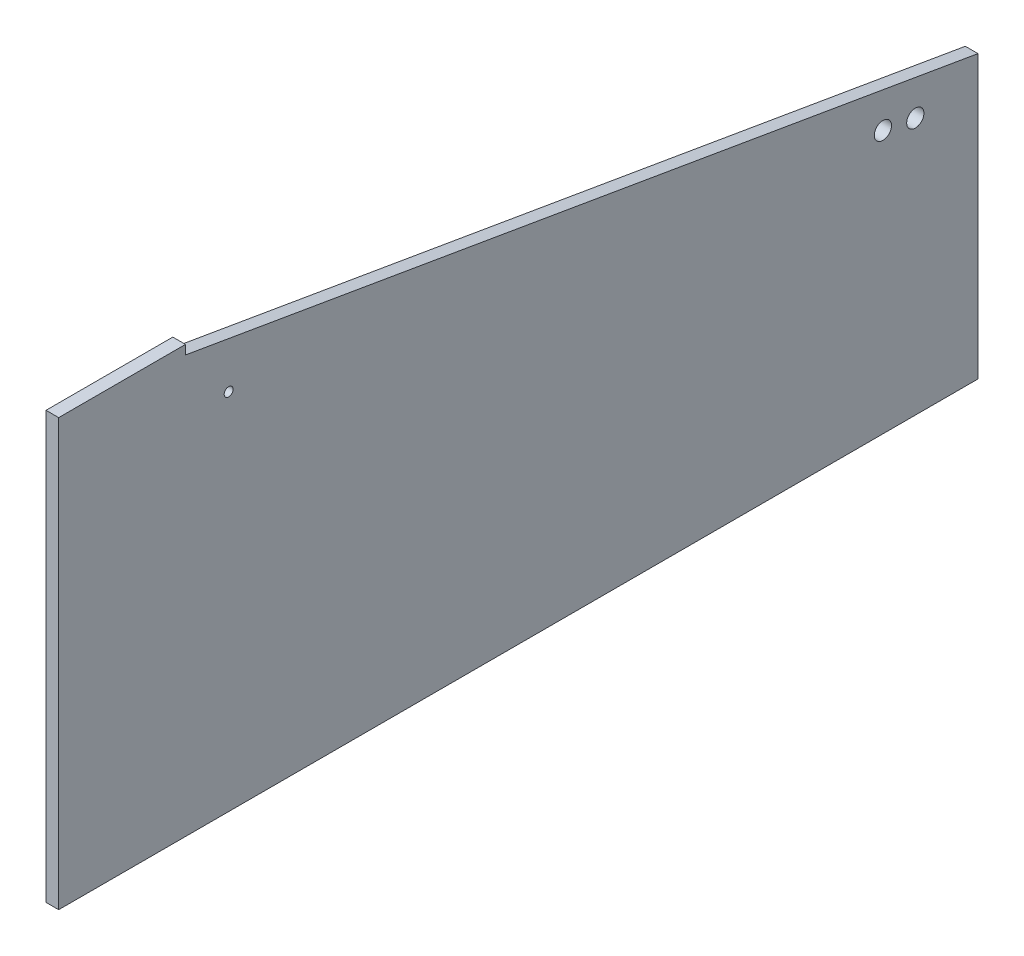
ISO-10303-21;
HEADER;
FILE_DESCRIPTION(('STEP AP214'),'2;1');
FILE_NAME('part.step','',(''),(''),'','','');
FILE_SCHEMA(('AUTOMOTIVE_DESIGN { 1 0 10303 214 1 1 1 1 }'));
ENDSEC;
DATA;
#1=APPLICATION_CONTEXT('core data for automotive mechanical design processes');
#2=APPLICATION_PROTOCOL_DEFINITION('international standard','automotive_design',2000,#1);
#3=PRODUCT_CONTEXT('',#1,'mechanical');
#4=PRODUCT('Part','Part','',(#3));
#5=PRODUCT_RELATED_PRODUCT_CATEGORY('part','',(#4));
#6=PRODUCT_DEFINITION_FORMATION('','',#4);
#7=PRODUCT_DEFINITION_CONTEXT('part definition',#1,'design');
#8=PRODUCT_DEFINITION('design','',#6,#7);
#9=PRODUCT_DEFINITION_SHAPE('','',#8);
#10=(LENGTH_UNIT() NAMED_UNIT(*) SI_UNIT(.MILLI.,.METRE.));
#11=(NAMED_UNIT(*) PLANE_ANGLE_UNIT() SI_UNIT($,.RADIAN.));
#12=(NAMED_UNIT(*) SI_UNIT($,.STERADIAN.) SOLID_ANGLE_UNIT());
#13=UNCERTAINTY_MEASURE_WITH_UNIT(LENGTH_MEASURE(1.E-05),#10,'distance_accuracy_value','');
#14=(GEOMETRIC_REPRESENTATION_CONTEXT(3) GLOBAL_UNCERTAINTY_ASSIGNED_CONTEXT((#13)) GLOBAL_UNIT_ASSIGNED_CONTEXT((#10,
#11,#12)) REPRESENTATION_CONTEXT('',''));
#15=CARTESIAN_POINT('',(0.,0.,0.));
#16=DIRECTION('',(0.,0.,1.));
#17=DIRECTION('',(1.,0.,0.));
#18=AXIS2_PLACEMENT_3D('',#15,#16,#17);
#19=CARTESIAN_POINT('',(18.,0.,0.));
#20=DIRECTION('',(-1.,0.,0.));
#21=DIRECTION('',(0.,0.,1.));
#22=AXIS2_PLACEMENT_3D('',#19,#20,#21);
#23=PLANE('',#22);
#24=CARTESIAN_POINT('',(18.,516.1,-241.3));
#25=DIRECTION('',(1.,0.,0.));
#26=DIRECTION('',(0.,0.,-1.));
#27=AXIS2_PLACEMENT_3D('',#24,#25,#26);
#28=CIRCLE('',#27,6.34999999999999);
#29=CARTESIAN_POINT('',(18.,516.1,-247.65));
#30=VERTEX_POINT('',#29);
#31=EDGE_CURVE('E181',#30,#30,#28,.T.);
#32=ORIENTED_EDGE('',*,*,#31,.F.);
#33=EDGE_LOOP('',(#32));
#34=FACE_BOUND('',#33,.T.);
#35=DIRECTION('',(0.,0.,-1.));
#36=VECTOR('',#35,1.);
#37=CARTESIAN_POINT('',(18.,0.,-1305.));
#38=LINE('',#37,#36);
#39=CARTESIAN_POINT('',(18.,0.,0.));
#40=VERTEX_POINT('',#39);
#41=CARTESIAN_POINT('',(18.,0.,-1305.));
#42=VERTEX_POINT('',#41);
#43=EDGE_CURVE('E132',#40,#42,#38,.T.);
#44=ORIENTED_EDGE('',*,*,#43,.T.);
#45=DIRECTION('',(0.,1.,0.));
#46=VECTOR('',#45,1.);
#47=CARTESIAN_POINT('',(18.,400.,-1305.));
#48=LINE('',#47,#46);
#49=CARTESIAN_POINT('',(18.,400.,-1305.));
#50=VERTEX_POINT('',#49);
#51=EDGE_CURVE('E90',#42,#50,#48,.T.);
#52=ORIENTED_EDGE('',*,*,#51,.T.);
#53=DIRECTION('',(0.,0.168234164861202,0.985747059733608));
#54=VECTOR('',#53,1.);
#55=CARTESIAN_POINT('',(18.,592.,-180.));
#56=LINE('',#55,#54);
#57=CARTESIAN_POINT('',(18.,592.,-180.));
#58=VERTEX_POINT('',#57);
#59=EDGE_CURVE('E103',#50,#58,#56,.T.);
#60=ORIENTED_EDGE('',*,*,#59,.T.);
#61=DIRECTION('',(0.,1.,0.));
#62=VECTOR('',#61,1.);
#63=CARTESIAN_POINT('',(18.,605.,-180.));
#64=LINE('',#63,#62);
#65=CARTESIAN_POINT('',(18.,605.,-180.));
#66=VERTEX_POINT('',#65);
#67=EDGE_CURVE('E97',#58,#66,#64,.T.);
#68=ORIENTED_EDGE('',*,*,#67,.T.);
#69=DIRECTION('',(0.,0.,1.));
#70=VECTOR('',#69,1.);
#71=CARTESIAN_POINT('',(18.,605.,0.));
#72=LINE('',#71,#70);
#73=CARTESIAN_POINT('',(18.,605.,0.));
#74=VERTEX_POINT('',#73);
#75=EDGE_CURVE('E101',#66,#74,#72,.T.);
#76=ORIENTED_EDGE('',*,*,#75,.T.);
#77=DIRECTION('',(0.,-1.,0.));
#78=VECTOR('',#77,1.);
#79=CARTESIAN_POINT('',(18.,0.,0.));
#80=LINE('',#79,#78);
#81=EDGE_CURVE('E53',#74,#40,#80,.T.);
#82=ORIENTED_EDGE('',*,*,#81,.T.);
#83=EDGE_LOOP('',(#44,#52,#60,#68,#76,#82));
#84=FACE_BOUND('',#83,.T.);
#85=CARTESIAN_POINT('',(18.,365.189333333333,-1216.));
#86=DIRECTION('',(1.,0.,0.));
#87=DIRECTION('',(0.,0.,-1.));
#88=AXIS2_PLACEMENT_3D('',#85,#86,#87);
#89=CIRCLE('',#88,12.25);
#90=CARTESIAN_POINT('',(18.,365.189333333333,-1228.25));
#91=VERTEX_POINT('',#90);
#92=EDGE_CURVE('E125',#91,#91,#89,.T.);
#93=ORIENTED_EDGE('',*,*,#92,.F.);
#94=EDGE_LOOP('',(#93));
#95=FACE_BOUND('',#94,.T.);
#96=CARTESIAN_POINT('',(18.,373.04,-1170.));
#97=DIRECTION('',(1.,0.,0.));
#98=DIRECTION('',(0.,0.,-1.));
#99=AXIS2_PLACEMENT_3D('',#96,#97,#98);
#100=CIRCLE('',#99,12.25);
#101=CARTESIAN_POINT('',(18.,373.04,-1182.25));
#102=VERTEX_POINT('',#101);
#103=EDGE_CURVE('E185',#102,#102,#100,.T.);
#104=ORIENTED_EDGE('',*,*,#103,.F.);
#105=EDGE_LOOP('',(#104));
#106=FACE_BOUND('',#105,.T.);
#107=ADVANCED_FACE('F35',(#34,#84,#95,#106),#23,.F.);
#108=CARTESIAN_POINT('',(0.,0.,0.));
#109=DIRECTION('',(-1.,0.,0.));
#110=DIRECTION('',(0.,0.,1.));
#111=AXIS2_PLACEMENT_3D('',#108,#109,#110);
#112=PLANE('',#111);
#113=CARTESIAN_POINT('',(0.,516.1,-241.3));
#114=DIRECTION('',(-1.,0.,0.));
#115=DIRECTION('',(0.,0.,1.));
#116=AXIS2_PLACEMENT_3D('',#113,#114,#115);
#117=CIRCLE('',#116,6.34999999999999);
#118=CARTESIAN_POINT('',(0.,516.1,-234.95));
#119=VERTEX_POINT('',#118);
#120=EDGE_CURVE('E39',#119,#119,#117,.T.);
#121=ORIENTED_EDGE('',*,*,#120,.F.);
#122=EDGE_LOOP('',(#121));
#123=FACE_BOUND('',#122,.T.);
#124=CARTESIAN_POINT('',(0.,365.189333333333,-1216.));
#125=DIRECTION('',(1.,0.,0.));
#126=DIRECTION('',(0.,0.,-1.));
#127=AXIS2_PLACEMENT_3D('',#124,#125,#126);
#128=CIRCLE('',#127,12.25);
#129=CARTESIAN_POINT('',(0.,365.189333333333,-1228.25));
#130=VERTEX_POINT('',#129);
#131=EDGE_CURVE('E188',#130,#130,#128,.T.);
#132=ORIENTED_EDGE('',*,*,#131,.T.);
#133=EDGE_LOOP('',(#132));
#134=FACE_BOUND('',#133,.T.);
#135=DIRECTION('',(0.,0.,-1.));
#136=VECTOR('',#135,1.);
#137=CARTESIAN_POINT('',(0.,0.,-1305.));
#138=LINE('',#137,#136);
#139=CARTESIAN_POINT('',(0.,0.,0.));
#140=VERTEX_POINT('',#139);
#141=CARTESIAN_POINT('',(0.,0.,-1305.));
#142=VERTEX_POINT('',#141);
#143=EDGE_CURVE('E121',#140,#142,#138,.T.);
#144=ORIENTED_EDGE('',*,*,#143,.F.);
#145=DIRECTION('',(0.,-1.,0.));
#146=VECTOR('',#145,1.);
#147=CARTESIAN_POINT('',(0.,0.,0.));
#148=LINE('',#147,#146);
#149=CARTESIAN_POINT('',(0.,605.,0.));
#150=VERTEX_POINT('',#149);
#151=EDGE_CURVE('E82',#150,#140,#148,.T.);
#152=ORIENTED_EDGE('',*,*,#151,.F.);
#153=DIRECTION('',(0.,0.,1.));
#154=VECTOR('',#153,1.);
#155=CARTESIAN_POINT('',(0.,605.,0.));
#156=LINE('',#155,#154);
#157=CARTESIAN_POINT('',(0.,605.,-180.));
#158=VERTEX_POINT('',#157);
#159=EDGE_CURVE('E76',#158,#150,#156,.T.);
#160=ORIENTED_EDGE('',*,*,#159,.F.);
#161=DIRECTION('',(0.,1.,0.));
#162=VECTOR('',#161,1.);
#163=CARTESIAN_POINT('',(0.,605.,-180.));
#164=LINE('',#163,#162);
#165=CARTESIAN_POINT('',(0.,592.,-180.));
#166=VERTEX_POINT('',#165);
#167=EDGE_CURVE('E111',#166,#158,#164,.T.);
#168=ORIENTED_EDGE('',*,*,#167,.F.);
#169=DIRECTION('',(0.,0.168234164861202,0.985747059733608));
#170=VECTOR('',#169,1.);
#171=CARTESIAN_POINT('',(0.,592.,-180.));
#172=LINE('',#171,#170);
#173=CARTESIAN_POINT('',(0.,400.,-1305.));
#174=VERTEX_POINT('',#173);
#175=EDGE_CURVE('E127',#174,#166,#172,.T.);
#176=ORIENTED_EDGE('',*,*,#175,.F.);
#177=DIRECTION('',(0.,1.,0.));
#178=VECTOR('',#177,1.);
#179=CARTESIAN_POINT('',(0.,400.,-1305.));
#180=LINE('',#179,#178);
#181=EDGE_CURVE('E124',#142,#174,#180,.T.);
#182=ORIENTED_EDGE('',*,*,#181,.F.);
#183=EDGE_LOOP('',(#144,#152,#160,#168,#176,#182));
#184=FACE_BOUND('',#183,.T.);
#185=CARTESIAN_POINT('',(0.,373.04,-1170.));
#186=DIRECTION('',(1.,0.,0.));
#187=DIRECTION('',(0.,0.,-1.));
#188=AXIS2_PLACEMENT_3D('',#185,#186,#187);
#189=CIRCLE('',#188,12.25);
#190=CARTESIAN_POINT('',(0.,373.04,-1182.25));
#191=VERTEX_POINT('',#190);
#192=EDGE_CURVE('E183',#191,#191,#189,.T.);
#193=ORIENTED_EDGE('',*,*,#192,.T.);
#194=EDGE_LOOP('',(#193));
#195=FACE_BOUND('',#194,.T.);
#196=ADVANCED_FACE('F142',(#123,#134,#184,#195),#112,.T.);
#197=CARTESIAN_POINT('',(18.,0.,-1305.));
#198=DIRECTION('',(0.,1.,0.));
#199=DIRECTION('',(0.,0.,1.));
#200=AXIS2_PLACEMENT_3D('',#197,#198,#199);
#201=PLANE('',#200);
#202=ORIENTED_EDGE('',*,*,#143,.T.);
#203=DIRECTION('',(-1.,0.,0.));
#204=VECTOR('',#203,1.);
#205=CARTESIAN_POINT('',(18.,0.,-1305.));
#206=LINE('',#205,#204);
#207=EDGE_CURVE('E11',#42,#142,#206,.T.);
#208=ORIENTED_EDGE('',*,*,#207,.F.);
#209=ORIENTED_EDGE('',*,*,#43,.F.);
#210=DIRECTION('',(-1.,0.,0.));
#211=VECTOR('',#210,1.);
#212=CARTESIAN_POINT('',(18.,0.,0.));
#213=LINE('',#212,#211);
#214=EDGE_CURVE('E117',#40,#140,#213,.T.);
#215=ORIENTED_EDGE('',*,*,#214,.T.);
#216=EDGE_LOOP('',(#202,#208,#209,#215));
#217=FACE_BOUND('',#216,.T.);
#218=ADVANCED_FACE('F37',(#217),#201,.F.);
#219=CARTESIAN_POINT('',(18.,400.,-1305.));
#220=DIRECTION('',(0.,0.,1.));
#221=DIRECTION('',(1.,0.,0.));
#222=AXIS2_PLACEMENT_3D('',#219,#220,#221);
#223=PLANE('',#222);
#224=ORIENTED_EDGE('',*,*,#181,.T.);
#225=DIRECTION('',(-1.,0.,0.));
#226=VECTOR('',#225,1.);
#227=CARTESIAN_POINT('',(18.,400.,-1305.));
#228=LINE('',#227,#226);
#229=EDGE_CURVE('E45',#50,#174,#228,.T.);
#230=ORIENTED_EDGE('',*,*,#229,.F.);
#231=ORIENTED_EDGE('',*,*,#51,.F.);
#232=ORIENTED_EDGE('',*,*,#207,.T.);
#233=EDGE_LOOP('',(#224,#230,#231,#232));
#234=FACE_BOUND('',#233,.T.);
#235=ADVANCED_FACE('F223',(#234),#223,.F.);
#236=CARTESIAN_POINT('',(18.,592.,-180.));
#237=DIRECTION('',(0.,-0.985747059733608,0.168234164861202));
#238=DIRECTION('',(0.,-0.168234164861202,-0.985747059733608));
#239=AXIS2_PLACEMENT_3D('',#236,#237,#238);
#240=PLANE('',#239);
#241=ORIENTED_EDGE('',*,*,#175,.T.);
#242=DIRECTION('',(-1.,0.,0.));
#243=VECTOR('',#242,1.);
#244=CARTESIAN_POINT('',(18.,592.,-180.));
#245=LINE('',#244,#243);
#246=EDGE_CURVE('E112',#58,#166,#245,.T.);
#247=ORIENTED_EDGE('',*,*,#246,.F.);
#248=ORIENTED_EDGE('',*,*,#59,.F.);
#249=ORIENTED_EDGE('',*,*,#229,.T.);
#250=EDGE_LOOP('',(#241,#247,#248,#249));
#251=FACE_BOUND('',#250,.T.);
#252=ADVANCED_FACE('F139',(#251),#240,.F.);
#253=CARTESIAN_POINT('',(18.,605.,-180.));
#254=DIRECTION('',(0.,0.,1.));
#255=DIRECTION('',(1.,0.,0.));
#256=AXIS2_PLACEMENT_3D('',#253,#254,#255);
#257=PLANE('',#256);
#258=ORIENTED_EDGE('',*,*,#167,.T.);
#259=DIRECTION('',(-1.,0.,0.));
#260=VECTOR('',#259,1.);
#261=CARTESIAN_POINT('',(18.,605.,-180.));
#262=LINE('',#261,#260);
#263=EDGE_CURVE('E108',#66,#158,#262,.T.);
#264=ORIENTED_EDGE('',*,*,#263,.F.);
#265=ORIENTED_EDGE('',*,*,#67,.F.);
#266=ORIENTED_EDGE('',*,*,#246,.T.);
#267=EDGE_LOOP('',(#258,#264,#265,#266));
#268=FACE_BOUND('',#267,.T.);
#269=ADVANCED_FACE('F109',(#268),#257,.F.);
#270=CARTESIAN_POINT('',(18.,605.,0.));
#271=DIRECTION('',(0.,-1.,0.));
#272=DIRECTION('',(0.,0.,-1.));
#273=AXIS2_PLACEMENT_3D('',#270,#271,#272);
#274=PLANE('',#273);
#275=ORIENTED_EDGE('',*,*,#159,.T.);
#276=DIRECTION('',(-1.,0.,0.));
#277=VECTOR('',#276,1.);
#278=CARTESIAN_POINT('',(18.,605.,0.));
#279=LINE('',#278,#277);
#280=EDGE_CURVE('E113',#74,#150,#279,.T.);
#281=ORIENTED_EDGE('',*,*,#280,.F.);
#282=ORIENTED_EDGE('',*,*,#75,.F.);
#283=ORIENTED_EDGE('',*,*,#263,.T.);
#284=EDGE_LOOP('',(#275,#281,#282,#283));
#285=FACE_BOUND('',#284,.T.);
#286=ADVANCED_FACE('F115',(#285),#274,.F.);
#287=CARTESIAN_POINT('',(18.,0.,0.));
#288=DIRECTION('',(0.,0.,-1.));
#289=DIRECTION('',(-1.,0.,0.));
#290=AXIS2_PLACEMENT_3D('',#287,#288,#289);
#291=PLANE('',#290);
#292=ORIENTED_EDGE('',*,*,#151,.T.);
#293=ORIENTED_EDGE('',*,*,#214,.F.);
#294=ORIENTED_EDGE('',*,*,#81,.F.);
#295=ORIENTED_EDGE('',*,*,#280,.T.);
#296=EDGE_LOOP('',(#292,#293,#294,#295));
#297=FACE_BOUND('',#296,.T.);
#298=ADVANCED_FACE('F147',(#297),#291,.F.);
#299=CARTESIAN_POINT('',(18.,365.189333333333,-1216.));
#300=DIRECTION('',(-1.,0.,0.));
#301=DIRECTION('',(0.,0.,1.));
#302=AXIS2_PLACEMENT_3D('',#299,#300,#301);
#303=CYLINDRICAL_SURFACE('',#302,12.25);
#304=ORIENTED_EDGE('',*,*,#92,.T.);
#305=EDGE_LOOP('',(#304));
#306=FACE_BOUND('',#305,.T.);
#307=ORIENTED_EDGE('',*,*,#131,.F.);
#308=EDGE_LOOP('',(#307));
#309=FACE_BOUND('',#308,.T.);
#310=ADVANCED_FACE('F149',(#306,#309),#303,.F.);
#311=CARTESIAN_POINT('',(18.,373.04,-1170.));
#312=DIRECTION('',(-1.,0.,0.));
#313=DIRECTION('',(0.,0.,1.));
#314=AXIS2_PLACEMENT_3D('',#311,#312,#313);
#315=CYLINDRICAL_SURFACE('',#314,12.25);
#316=ORIENTED_EDGE('',*,*,#103,.T.);
#317=EDGE_LOOP('',(#316));
#318=FACE_BOUND('',#317,.T.);
#319=ORIENTED_EDGE('',*,*,#192,.F.);
#320=EDGE_LOOP('',(#319));
#321=FACE_BOUND('',#320,.T.);
#322=ADVANCED_FACE('F155',(#318,#321),#315,.F.);
#323=CARTESIAN_POINT('',(-22.,516.1,-241.3));
#324=DIRECTION('',(1.,0.,0.));
#325=DIRECTION('',(0.,0.,-1.));
#326=AXIS2_PLACEMENT_3D('',#323,#324,#325);
#327=CYLINDRICAL_SURFACE('',#326,6.34999999999999);
#328=ORIENTED_EDGE('',*,*,#120,.T.);
#329=EDGE_LOOP('',(#328));
#330=FACE_BOUND('',#329,.T.);
#331=ORIENTED_EDGE('',*,*,#31,.T.);
#332=EDGE_LOOP('',(#331));
#333=FACE_BOUND('',#332,.T.);
#334=ADVANCED_FACE('F171',(#330,#333),#327,.F.);
#335=CLOSED_SHELL('',(#107,#196,#218,#235,#252,#269,#286,#298,#310,#322,#334));
#336=MANIFOLD_SOLID_BREP('B2',#335);
#337=ADVANCED_BREP_SHAPE_REPRESENTATION('',(#18,#336),#14);
#338=SHAPE_DEFINITION_REPRESENTATION(#9,#337);
ENDSEC;
END-ISO-10303-21;
